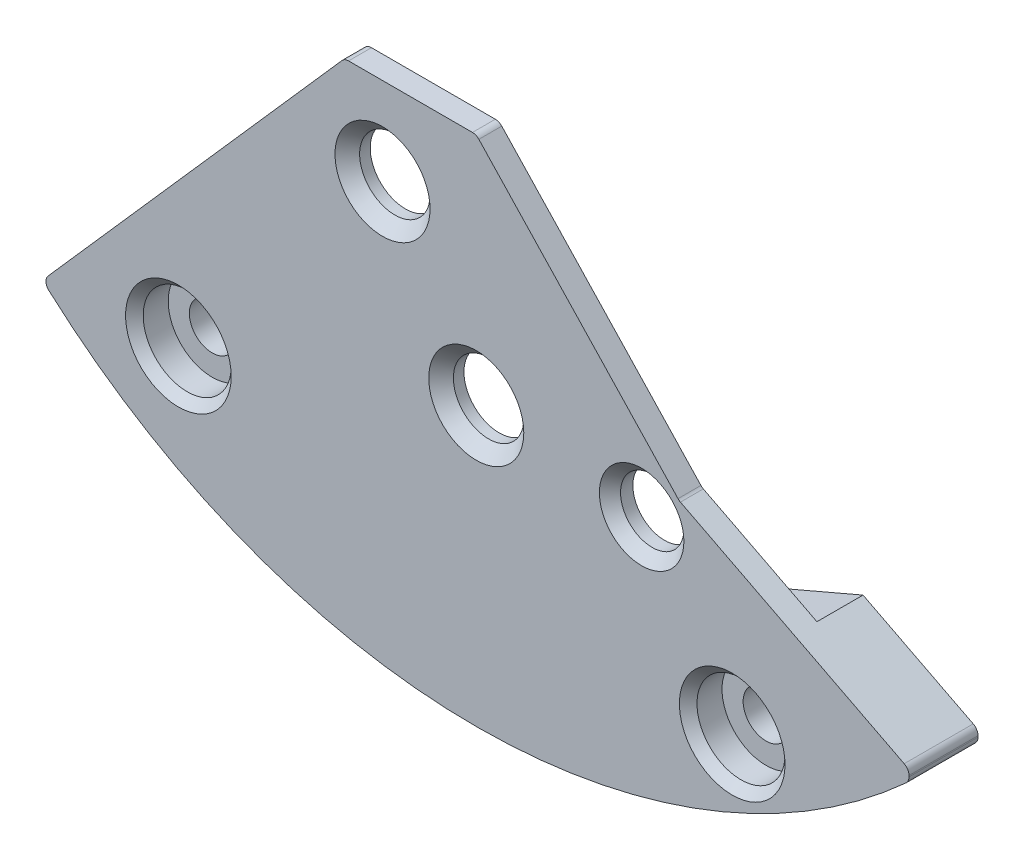
ISO-10303-21;
HEADER;
FILE_DESCRIPTION(('STEP AP214'),'2;1');
FILE_NAME('part.step','',(''),(''),'','','');
FILE_SCHEMA(('AUTOMOTIVE_DESIGN { 1 0 10303 214 1 1 1 1 }'));
ENDSEC;
DATA;
#1=APPLICATION_CONTEXT('core data for automotive mechanical design processes');
#2=APPLICATION_PROTOCOL_DEFINITION('international standard','automotive_design',2000,#1);
#3=PRODUCT_CONTEXT('',#1,'mechanical');
#4=PRODUCT('Part','Part','',(#3));
#5=PRODUCT_RELATED_PRODUCT_CATEGORY('part','',(#4));
#6=PRODUCT_DEFINITION_FORMATION('','',#4);
#7=PRODUCT_DEFINITION_CONTEXT('part definition',#1,'design');
#8=PRODUCT_DEFINITION('design','',#6,#7);
#9=PRODUCT_DEFINITION_SHAPE('','',#8);
#10=(LENGTH_UNIT() NAMED_UNIT(*) SI_UNIT(.MILLI.,.METRE.));
#11=(NAMED_UNIT(*) PLANE_ANGLE_UNIT() SI_UNIT($,.RADIAN.));
#12=(NAMED_UNIT(*) SI_UNIT($,.STERADIAN.) SOLID_ANGLE_UNIT());
#13=UNCERTAINTY_MEASURE_WITH_UNIT(LENGTH_MEASURE(1.E-05),#10,'distance_accuracy_value','');
#14=(GEOMETRIC_REPRESENTATION_CONTEXT(3) GLOBAL_UNCERTAINTY_ASSIGNED_CONTEXT((#13)) GLOBAL_UNIT_ASSIGNED_CONTEXT((#10,
#11,#12)) REPRESENTATION_CONTEXT('',''));
#15=CARTESIAN_POINT('',(0.,0.,0.));
#16=DIRECTION('',(0.,0.,1.));
#17=DIRECTION('',(1.,0.,0.));
#18=AXIS2_PLACEMENT_3D('',#15,#16,#17);
#19=CARTESIAN_POINT('',(0.,0.,0.960000000000001));
#20=DIRECTION('',(0.,0.,1.));
#21=DIRECTION('',(1.,0.,0.));
#22=AXIS2_PLACEMENT_3D('',#19,#20,#21);
#23=PLANE('',#22);
#24=CARTESIAN_POINT('',(-8.45980191055556,-13.0192810651391,0.960000000000001));
#25=DIRECTION('',(0.,0.,-1.));
#26=DIRECTION('',(1.,0.,0.));
#27=AXIS2_PLACEMENT_3D('',#24,#25,#26);
#28=CIRCLE('',#27,4.);
#29=CARTESIAN_POINT('',(-4.56391734086788,-12.1125929050369,0.960000000000001));
#30=VERTEX_POINT('',#29);
#31=CARTESIAN_POINT('',(-7.00300327673048,-16.7445646436718,0.960000000000001));
#32=VERTEX_POINT('',#31);
#33=EDGE_CURVE('E199',#30,#32,#28,.T.);
#34=ORIENTED_EDGE('',*,*,#33,.F.);
#35=DIRECTION('',(0.685364699004991,-0.728199992692803,0.));
#36=VECTOR('',#35,1.);
#37=CARTESIAN_POINT('',(-1.14381879762604,-15.7464476072314,0.960000000000001));
#38=LINE('',#37,#36);
#39=CARTESIAN_POINT('',(-3.3497199663869,-13.402677615423,0.960000000000001));
#40=VERTEX_POINT('',#39);
#41=EDGE_CURVE('E187',#30,#40,#38,.T.);
#42=ORIENTED_EDGE('',*,*,#41,.T.);
#43=CARTESIAN_POINT('',(0.,-10.25,0.960000000000001));
#44=DIRECTION('',(0.,0.,1.));
#45=DIRECTION('',(1.,0.,0.));
#46=AXIS2_PLACEMENT_3D('',#43,#44,#45);
#47=CIRCLE('',#46,4.6);
#48=CARTESIAN_POINT('',(1.81394739478823,-14.4772443564267,0.960000000000001));
#49=VERTEX_POINT('',#48);
#50=EDGE_CURVE('E11',#40,#49,#47,.T.);
#51=ORIENTED_EDGE('',*,*,#50,.T.);
#52=DIRECTION('',(0.918966164440577,0.394336390171355,0.));
#53=VECTOR('',#52,1.);
#54=CARTESIAN_POINT('',(5.12641025322723,-13.0558376749645,0.960000000000001));
#55=LINE('',#54,#53);
#56=CARTESIAN_POINT('',(3.36982635811158,-13.8096031334073,0.960000000000001));
#57=VERTEX_POINT('',#56);
#58=EDGE_CURVE('E324',#49,#57,#55,.T.);
#59=ORIENTED_EDGE('',*,*,#58,.T.);
#60=CARTESIAN_POINT('',(7.26938383343995,-14.7003620775727,0.960000000000001));
#61=DIRECTION('',(0.,0.,-1.));
#62=DIRECTION('',(1.,0.,0.));
#63=AXIS2_PLACEMENT_3D('',#60,#61,#62);
#64=CIRCLE('',#63,4.);
#65=CARTESIAN_POINT('',(4.49726769874477,-17.5840007747335,0.960000000000001));
#66=VERTEX_POINT('',#65);
#67=EDGE_CURVE('E206',#66,#57,#64,.T.);
#68=ORIENTED_EDGE('',*,*,#67,.F.);
#69=CARTESIAN_POINT('',(0.,0.,0.960000000000001));
#70=DIRECTION('',(0.,0.,-1.));
#71=DIRECTION('',(1.,0.,0.));
#72=AXIS2_PLACEMENT_3D('',#69,#70,#71);
#73=CIRCLE('',#72,18.15);
#74=EDGE_CURVE('E226',#66,#32,#73,.T.);
#75=ORIENTED_EDGE('',*,*,#74,.T.);
#76=EDGE_LOOP('',(#34,#42,#51,#59,#68,#75));
#77=FACE_BOUND('',#76,.T.);
#78=ADVANCED_FACE('F32',(#77),#23,.F.);
#79=CARTESIAN_POINT('',(0.,0.,1.31));
#80=DIRECTION('',(0.,0.,1.));
#81=DIRECTION('',(1.,0.,0.));
#82=AXIS2_PLACEMENT_3D('',#79,#80,#81);
#83=PLANE('',#82);
#84=CARTESIAN_POINT('',(4.69701770194955,-10.6460002522325,1.31));
#85=DIRECTION('',(0.,0.,1.));
#86=DIRECTION('',(1.,0.,0.));
#87=AXIS2_PLACEMENT_3D('',#84,#85,#86);
#88=CIRCLE('',#87,0.900000000000006);
#89=CARTESIAN_POINT('',(5.59701770194956,-10.6460002522325,1.31));
#90=VERTEX_POINT('',#89);
#91=EDGE_CURVE('E274',#90,#90,#88,.T.);
#92=ORIENTED_EDGE('',*,*,#91,.T.);
#93=EDGE_LOOP('',(#92));
#94=FACE_BOUND('',#93,.T.);
#95=CARTESIAN_POINT('',(0.,-10.25,1.31));
#96=DIRECTION('',(0.,0.,1.));
#97=DIRECTION('',(1.,0.,0.));
#98=AXIS2_PLACEMENT_3D('',#95,#96,#97);
#99=CIRCLE('',#98,1.00000000000001);
#100=CARTESIAN_POINT('',(1.00000000000001,-10.25,1.31));
#101=VERTEX_POINT('',#100);
#102=EDGE_CURVE('E269',#101,#101,#99,.T.);
#103=ORIENTED_EDGE('',*,*,#102,.T.);
#104=EDGE_LOOP('',(#103));
#105=FACE_BOUND('',#104,.T.);
#106=CARTESIAN_POINT('',(-2.66226199830052,-6.07408479977046,1.31));
#107=DIRECTION('',(0.,0.,1.));
#108=DIRECTION('',(1.,0.,0.));
#109=AXIS2_PLACEMENT_3D('',#106,#107,#108);
#110=CIRCLE('',#109,1.00000000000001);
#111=CARTESIAN_POINT('',(-1.66226199830051,-6.07408479977046,1.31));
#112=VERTEX_POINT('',#111);
#113=EDGE_CURVE('E264',#112,#112,#110,.T.);
#114=ORIENTED_EDGE('',*,*,#113,.T.);
#115=EDGE_LOOP('',(#114));
#116=FACE_BOUND('',#115,.T.);
#117=DIRECTION('',(0.918966164440577,0.394336390171355,0.));
#118=VECTOR('',#117,1.);
#119=CARTESIAN_POINT('',(5.12641025322723,-13.0558376749645,1.31));
#120=LINE('',#119,#118);
#121=CARTESIAN_POINT('',(1.81394739478823,-14.4772443564267,1.31));
#122=VERTEX_POINT('',#121);
#123=CARTESIAN_POINT('',(9.02500000000001,-11.3829188374822,1.31));
#124=VERTEX_POINT('',#123);
#125=EDGE_CURVE('E236',#122,#124,#120,.T.);
#126=ORIENTED_EDGE('',*,*,#125,.F.);
#127=CARTESIAN_POINT('',(0.,-10.25,1.31));
#128=DIRECTION('',(0.,0.,1.));
#129=DIRECTION('',(1.,0.,0.));
#130=AXIS2_PLACEMENT_3D('',#127,#128,#129);
#131=CIRCLE('',#130,4.6);
#132=CARTESIAN_POINT('',(-3.3497199663869,-13.402677615423,1.31));
#133=VERTEX_POINT('',#132);
#134=EDGE_CURVE('E54',#122,#133,#131,.F.);
#135=ORIENTED_EDGE('',*,*,#134,.T.);
#136=DIRECTION('',(0.685364699004991,-0.728199992692803,0.));
#137=VECTOR('',#136,1.);
#138=CARTESIAN_POINT('',(-1.14381879762604,-15.7464476072314,1.31));
#139=LINE('',#138,#137);
#140=CARTESIAN_POINT('',(-8.01670997456033,-8.44400073173869,1.31));
#141=VERTEX_POINT('',#140);
#142=EDGE_CURVE('E322',#141,#133,#139,.T.);
#143=ORIENTED_EDGE('',*,*,#142,.F.);
#144=DIRECTION('',(-0.661079843281002,-0.75031556081929,0.));
#145=VECTOR('',#144,1.);
#146=CARTESIAN_POINT('',(-3.74,-3.59,1.31));
#147=LINE('',#146,#145);
#148=CARTESIAN_POINT('',(-3.81465301793952,-3.67473003917975,1.31));
#149=VERTEX_POINT('',#148);
#150=EDGE_CURVE('E185',#149,#141,#147,.T.);
#151=ORIENTED_EDGE('',*,*,#150,.F.);
#152=CARTESIAN_POINT('',(-3.62707412773469,-3.84,1.31));
#153=DIRECTION('',(0.,0.,1.));
#154=DIRECTION('',(1.,0.,0.));
#155=AXIS2_PLACEMENT_3D('',#152,#153,#154);
#156=CIRCLE('',#155,0.25);
#157=CARTESIAN_POINT('',(-3.62707412773469,-3.59,1.31));
#158=VERTEX_POINT('',#157);
#159=EDGE_CURVE('E391',#149,#158,#156,.F.);
#160=ORIENTED_EDGE('',*,*,#159,.T.);
#161=DIRECTION('',(-1.,0.,0.));
#162=VECTOR('',#161,1.);
#163=CARTESIAN_POINT('',(12.29,-3.59,1.31));
#164=LINE('',#163,#162);
#165=CARTESIAN_POINT('',(-0.108018162644958,-3.59,1.31));
#166=VERTEX_POINT('',#165);
#167=EDGE_CURVE('E305',#166,#158,#164,.T.);
#168=ORIENTED_EDGE('',*,*,#167,.F.);
#169=CARTESIAN_POINT('',(-0.108018162644958,-3.84,1.31));
#170=DIRECTION('',(0.,0.,1.));
#171=DIRECTION('',(1.,0.,0.));
#172=AXIS2_PLACEMENT_3D('',#169,#170,#171);
#173=CIRCLE('',#172,0.25);
#174=CARTESIAN_POINT('',(0.0740318355282419,-3.66865882524875,1.31));
#175=VERTEX_POINT('',#174);
#176=EDGE_CURVE('E419',#166,#175,#173,.F.);
#177=ORIENTED_EDGE('',*,*,#176,.T.);
#178=DIRECTION('',(-0.685364699004993,0.728199992692801,0.));
#179=VECTOR('',#178,1.);
#180=CARTESIAN_POINT('',(-1.79170642201835,-1.68631192660551,1.31));
#181=LINE('',#180,#179);
#182=CARTESIAN_POINT('',(5.73039494494946,-9.67854462900876,1.31));
#183=VERTEX_POINT('',#182);
#184=EDGE_CURVE('E243',#183,#175,#181,.T.);
#185=ORIENTED_EDGE('',*,*,#184,.F.);
#186=CARTESIAN_POINT('',(5.91244494312266,-9.50720345425751,1.31));
#187=DIRECTION('',(0.,0.,1.));
#188=DIRECTION('',(1.,0.,0.));
#189=AXIS2_PLACEMENT_3D('',#186,#187,#188);
#190=CIRCLE('',#189,0.25);
#191=CARTESIAN_POINT('',(5.79844349178114,-9.72969765438872,1.31));
#192=VERTEX_POINT('',#191);
#193=EDGE_CURVE('E421',#183,#192,#190,.T.);
#194=ORIENTED_EDGE('',*,*,#193,.T.);
#195=DIRECTION('',(0.88997680052485,-0.456005805366063,0.));
#196=VECTOR('',#195,1.);
#197=CARTESIAN_POINT('',(12.29,-13.0558376749645,1.31));
#198=LINE('',#197,#196);
#199=EDGE_CURVE('E242',#192,#124,#198,.T.);
#200=ORIENTED_EDGE('',*,*,#199,.T.);
#201=EDGE_LOOP('',(#126,#135,#143,#151,#160,#168,#177,#185,#194,#200));
#202=FACE_BOUND('',#201,.T.);
#203=ADVANCED_FACE('F431',(#94,#105,#116,#202),#83,.F.);
#204=CARTESIAN_POINT('',(12.29,-3.59,1.31));
#205=DIRECTION('',(0.,1.,0.));
#206=DIRECTION('',(-1.,0.,0.));
#207=AXIS2_PLACEMENT_3D('',#204,#205,#206);
#208=PLANE('',#207);
#209=DIRECTION('',(-1.,0.,0.));
#210=VECTOR('',#209,1.);
#211=CARTESIAN_POINT('',(12.29,-3.59,1.96));
#212=LINE('',#211,#210);
#213=CARTESIAN_POINT('',(-0.108018162644958,-3.59,1.96));
#214=VERTEX_POINT('',#213);
#215=CARTESIAN_POINT('',(-3.62707412773469,-3.59,1.96));
#216=VERTEX_POINT('',#215);
#217=EDGE_CURVE('E249',#214,#216,#212,.T.);
#218=ORIENTED_EDGE('',*,*,#217,.F.);
#219=DIRECTION('',(0.,0.,1.));
#220=VECTOR('',#219,1.);
#221=CARTESIAN_POINT('',(-0.108018162644958,-3.59,1.31));
#222=LINE('',#221,#220);
#223=EDGE_CURVE('E416',#214,#166,#222,.F.);
#224=ORIENTED_EDGE('',*,*,#223,.T.);
#225=ORIENTED_EDGE('',*,*,#167,.T.);
#226=DIRECTION('',(0.,0.,1.));
#227=VECTOR('',#226,1.);
#228=CARTESIAN_POINT('',(-3.62707412773469,-3.59,1.31));
#229=LINE('',#228,#227);
#230=EDGE_CURVE('E414',#158,#216,#229,.T.);
#231=ORIENTED_EDGE('',*,*,#230,.T.);
#232=EDGE_LOOP('',(#218,#224,#225,#231));
#233=FACE_BOUND('',#232,.T.);
#234=ADVANCED_FACE('F474',(#233),#208,.T.);
#235=CARTESIAN_POINT('',(12.29,-13.3558376749645,1.31));
#236=DIRECTION('',(1.,0.,0.));
#237=DIRECTION('',(0.,1.,0.));
#238=AXIS2_PLACEMENT_3D('',#235,#236,#237);
#239=PLANE('',#238);
#240=DIRECTION('',(0.,-1.,0.));
#241=VECTOR('',#240,1.);
#242=CARTESIAN_POINT('',(12.29,-13.3558376749645,0.));
#243=LINE('',#242,#241);
#244=CARTESIAN_POINT('',(12.29,-13.2086490163143,0.));
#245=VERTEX_POINT('',#244);
#246=CARTESIAN_POINT('',(12.29,-13.2456936398212,0.));
#247=VERTEX_POINT('',#246);
#248=EDGE_CURVE('E207',#245,#247,#243,.T.);
#249=ORIENTED_EDGE('',*,*,#248,.F.);
#250=DIRECTION('',(0.,0.,1.));
#251=VECTOR('',#250,1.);
#252=CARTESIAN_POINT('',(12.29,-13.2086490163143,1.96));
#253=LINE('',#252,#251);
#254=CARTESIAN_POINT('',(12.29,-13.2086490163143,1.96));
#255=VERTEX_POINT('',#254);
#256=EDGE_CURVE('E412',#245,#255,#253,.T.);
#257=ORIENTED_EDGE('',*,*,#256,.T.);
#258=DIRECTION('',(0.,1.,0.));
#259=VECTOR('',#258,1.);
#260=CARTESIAN_POINT('',(12.29,-13.3558376749645,1.96));
#261=LINE('',#260,#259);
#262=CARTESIAN_POINT('',(12.29,-13.2456936398212,1.96));
#263=VERTEX_POINT('',#262);
#264=EDGE_CURVE('E319',#263,#255,#261,.T.);
#265=ORIENTED_EDGE('',*,*,#264,.F.);
#266=DIRECTION('',(0.,0.,1.));
#267=VECTOR('',#266,1.);
#268=CARTESIAN_POINT('',(12.29,-13.2456936398212,1.31));
#269=LINE('',#268,#267);
#270=EDGE_CURVE('E410',#263,#247,#269,.F.);
#271=ORIENTED_EDGE('',*,*,#270,.T.);
#272=EDGE_LOOP('',(#249,#257,#265,#271));
#273=FACE_BOUND('',#272,.T.);
#274=ADVANCED_FACE('F454',(#273),#239,.T.);
#275=CARTESIAN_POINT('',(0.,0.,1.31));
#276=DIRECTION('',(0.,0.,1.));
#277=DIRECTION('',(1.,0.,0.));
#278=AXIS2_PLACEMENT_3D('',#275,#276,#277);
#279=CYLINDRICAL_SURFACE('',#278,18.15);
#280=CARTESIAN_POINT('',(0.,0.,1.96));
#281=DIRECTION('',(0.,0.,1.));
#282=DIRECTION('',(1.,0.,0.));
#283=AXIS2_PLACEMENT_3D('',#280,#281,#282);
#284=CIRCLE('',#283,18.15);
#285=CARTESIAN_POINT('',(-12.1371248404832,-13.4949138791815,1.96));
#286=VERTEX_POINT('',#285);
#287=CARTESIAN_POINT('',(12.208156424581,-13.4306893610478,1.96));
#288=VERTEX_POINT('',#287);
#289=EDGE_CURVE('E316',#286,#288,#284,.T.);
#290=ORIENTED_EDGE('',*,*,#289,.F.);
#291=DIRECTION('',(0.,0.,1.));
#292=VECTOR('',#291,1.);
#293=CARTESIAN_POINT('',(-12.1371248404832,-13.4949138791815,1.31));
#294=LINE('',#293,#292);
#295=CARTESIAN_POINT('',(-12.1371248404832,-13.4949138791815,0.));
#296=VERTEX_POINT('',#295);
#297=EDGE_CURVE('E345',#286,#296,#294,.F.);
#298=ORIENTED_EDGE('',*,*,#297,.T.);
#299=CARTESIAN_POINT('',(0.,0.,0.));
#300=DIRECTION('',(0.,0.,-1.));
#301=DIRECTION('',(1.,0.,0.));
#302=AXIS2_PLACEMENT_3D('',#299,#300,#301);
#303=CIRCLE('',#302,18.15);
#304=CARTESIAN_POINT('',(-7.00300327673048,-16.7445646436718,0.));
#305=VERTEX_POINT('',#304);
#306=EDGE_CURVE('E179',#305,#296,#303,.T.);
#307=ORIENTED_EDGE('',*,*,#306,.F.);
#308=DIRECTION('',(0.,0.,1.));
#309=VECTOR('',#308,1.);
#310=CARTESIAN_POINT('',(-7.00300327673048,-16.7445646436718,0.));
#311=LINE('',#310,#309);
#312=EDGE_CURVE('E195',#305,#32,#311,.T.);
#313=ORIENTED_EDGE('',*,*,#312,.T.);
#314=ORIENTED_EDGE('',*,*,#74,.F.);
#315=DIRECTION('',(0.,0.,1.));
#316=VECTOR('',#315,1.);
#317=CARTESIAN_POINT('',(4.49726769874478,-17.5840007747335,0.));
#318=LINE('',#317,#316);
#319=CARTESIAN_POINT('',(4.49726769874478,-17.5840007747335,0.));
#320=VERTEX_POINT('',#319);
#321=EDGE_CURVE('E231',#320,#66,#318,.T.);
#322=ORIENTED_EDGE('',*,*,#321,.F.);
#323=CARTESIAN_POINT('',(0.,0.,0.));
#324=DIRECTION('',(0.,0.,-1.));
#325=DIRECTION('',(1.,0.,0.));
#326=AXIS2_PLACEMENT_3D('',#323,#324,#325);
#327=CIRCLE('',#326,18.15);
#328=CARTESIAN_POINT('',(12.208156424581,-13.4306893610478,0.));
#329=VERTEX_POINT('',#328);
#330=EDGE_CURVE('E210',#329,#320,#327,.T.);
#331=ORIENTED_EDGE('',*,*,#330,.F.);
#332=DIRECTION('',(0.,0.,1.));
#333=VECTOR('',#332,1.);
#334=CARTESIAN_POINT('',(12.208156424581,-13.4306893610478,1.31));
#335=LINE('',#334,#333);
#336=EDGE_CURVE('E401',#329,#288,#335,.T.);
#337=ORIENTED_EDGE('',*,*,#336,.T.);
#338=EDGE_LOOP('',(#290,#298,#307,#313,#314,#322,#331,#337));
#339=FACE_BOUND('',#338,.T.);
#340=ADVANCED_FACE('F343',(#339),#279,.T.);
#341=CARTESIAN_POINT('',(-3.74,-3.59,1.31));
#342=DIRECTION('',(-0.75031556081929,0.661079843281002,0.));
#343=DIRECTION('',(-0.661079843281002,-0.75031556081929,0.));
#344=AXIS2_PLACEMENT_3D('',#341,#342,#343);
#345=PLANE('',#344);
#346=DIRECTION('',(0.661079843281002,0.75031556081929,0.));
#347=VECTOR('',#346,1.);
#348=CARTESIAN_POINT('',(-8.01670997456033,-8.44400073173869,0.));
#349=LINE('',#348,#347);
#350=CARTESIAN_POINT('',(-12.1575257025822,-13.1437635618987,0.));
#351=VERTEX_POINT('',#350);
#352=CARTESIAN_POINT('',(-8.01670997456033,-8.44400073173869,0.));
#353=VERTEX_POINT('',#352);
#354=EDGE_CURVE('E167',#351,#353,#349,.T.);
#355=ORIENTED_EDGE('',*,*,#354,.F.);
#356=DIRECTION('',(0.,0.,1.));
#357=VECTOR('',#356,1.);
#358=CARTESIAN_POINT('',(-12.1575257025822,-13.1437635618987,1.31));
#359=LINE('',#358,#357);
#360=CARTESIAN_POINT('',(-12.1575257025822,-13.1437635618987,1.96));
#361=VERTEX_POINT('',#360);
#362=EDGE_CURVE('E385',#351,#361,#359,.T.);
#363=ORIENTED_EDGE('',*,*,#362,.T.);
#364=DIRECTION('',(-0.661079843281002,-0.75031556081929,0.));
#365=VECTOR('',#364,1.);
#366=CARTESIAN_POINT('',(-3.74,-3.59,1.96));
#367=LINE('',#366,#365);
#368=CARTESIAN_POINT('',(-3.81465301793952,-3.67473003917975,1.96));
#369=VERTEX_POINT('',#368);
#370=EDGE_CURVE('E313',#369,#361,#367,.T.);
#371=ORIENTED_EDGE('',*,*,#370,.F.);
#372=DIRECTION('',(0.,0.,1.));
#373=VECTOR('',#372,1.);
#374=CARTESIAN_POINT('',(-3.81465301793952,-3.67473003917975,1.31));
#375=LINE('',#374,#373);
#376=EDGE_CURVE('E302',#369,#149,#375,.F.);
#377=ORIENTED_EDGE('',*,*,#376,.T.);
#378=ORIENTED_EDGE('',*,*,#150,.T.);
#379=DIRECTION('',(0.,0.,1.));
#380=VECTOR('',#379,1.);
#381=CARTESIAN_POINT('',(-8.01670997456033,-8.44400073173869,0.960000000000001));
#382=LINE('',#381,#380);
#383=EDGE_CURVE('E182',#353,#141,#382,.T.);
#384=ORIENTED_EDGE('',*,*,#383,.F.);
#385=EDGE_LOOP('',(#355,#363,#371,#377,#378,#384));
#386=FACE_BOUND('',#385,.T.);
#387=ADVANCED_FACE('F183',(#386),#345,.T.);
#388=CARTESIAN_POINT('',(0.,0.,1.96));
#389=DIRECTION('',(0.,0.,1.));
#390=DIRECTION('',(1.,0.,0.));
#391=AXIS2_PLACEMENT_3D('',#388,#389,#390);
#392=PLANE('',#391);
#393=CARTESIAN_POINT('',(-8.45980191055556,-13.0192810651391,1.96));
#394=DIRECTION('',(0.,0.,1.));
#395=DIRECTION('',(1.,0.,0.));
#396=AXIS2_PLACEMENT_3D('',#393,#394,#395);
#397=CIRCLE('',#396,1.50000000000002);
#398=CARTESIAN_POINT('',(-6.95980191055555,-13.0192810651391,1.96));
#399=VERTEX_POINT('',#398);
#400=EDGE_CURVE('E285',#399,#399,#397,.F.);
#401=ORIENTED_EDGE('',*,*,#400,.T.);
#402=EDGE_LOOP('',(#401));
#403=FACE_BOUND('',#402,.T.);
#404=CARTESIAN_POINT('',(7.26938383343995,-14.7003620775727,1.96));
#405=DIRECTION('',(0.,0.,1.));
#406=DIRECTION('',(1.,0.,0.));
#407=AXIS2_PLACEMENT_3D('',#404,#405,#406);
#408=CIRCLE('',#407,1.50000000000002);
#409=CARTESIAN_POINT('',(8.76938383343996,-14.7003620775727,1.96));
#410=VERTEX_POINT('',#409);
#411=EDGE_CURVE('E282',#410,#410,#408,.F.);
#412=ORIENTED_EDGE('',*,*,#411,.T.);
#413=EDGE_LOOP('',(#412));
#414=FACE_BOUND('',#413,.T.);
#415=CARTESIAN_POINT('',(4.69701770194955,-10.6460002522325,1.96));
#416=DIRECTION('',(0.,0.,1.));
#417=DIRECTION('',(1.,0.,0.));
#418=AXIS2_PLACEMENT_3D('',#415,#416,#417);
#419=CIRCLE('',#418,1.2);
#420=CARTESIAN_POINT('',(5.89701770194955,-10.6460002522325,1.96));
#421=VERTEX_POINT('',#420);
#422=EDGE_CURVE('E365',#421,#421,#419,.T.);
#423=ORIENTED_EDGE('',*,*,#422,.F.);
#424=EDGE_LOOP('',(#423));
#425=FACE_BOUND('',#424,.T.);
#426=CARTESIAN_POINT('',(0.,-10.25,1.96));
#427=DIRECTION('',(0.,0.,1.));
#428=DIRECTION('',(1.,0.,0.));
#429=AXIS2_PLACEMENT_3D('',#426,#427,#428);
#430=CIRCLE('',#429,1.35);
#431=CARTESIAN_POINT('',(1.35,-10.25,1.96));
#432=VERTEX_POINT('',#431);
#433=EDGE_CURVE('E277',#432,#432,#430,.T.);
#434=ORIENTED_EDGE('',*,*,#433,.F.);
#435=EDGE_LOOP('',(#434));
#436=FACE_BOUND('',#435,.T.);
#437=CARTESIAN_POINT('',(-2.66226199830052,-6.07408479977046,1.96));
#438=DIRECTION('',(0.,0.,1.));
#439=DIRECTION('',(1.,0.,0.));
#440=AXIS2_PLACEMENT_3D('',#437,#438,#439);
#441=CIRCLE('',#440,1.35);
#442=CARTESIAN_POINT('',(-1.31226199830052,-6.07408479977046,1.96));
#443=VERTEX_POINT('',#442);
#444=EDGE_CURVE('E272',#443,#443,#441,.T.);
#445=ORIENTED_EDGE('',*,*,#444,.F.);
#446=EDGE_LOOP('',(#445));
#447=FACE_BOUND('',#446,.T.);
#448=ORIENTED_EDGE('',*,*,#370,.T.);
#449=CARTESIAN_POINT('',(-11.9699468123774,-13.3090335227189,1.96));
#450=DIRECTION('',(0.,0.,1.));
#451=DIRECTION('',(1.,0.,0.));
#452=AXIS2_PLACEMENT_3D('',#449,#450,#451);
#453=CIRCLE('',#452,0.25);
#454=EDGE_CURVE('E382',#361,#286,#453,.T.);
#455=ORIENTED_EDGE('',*,*,#454,.T.);
#456=ORIENTED_EDGE('',*,*,#289,.T.);
#457=CARTESIAN_POINT('',(12.04,-13.2456936398212,1.96));
#458=DIRECTION('',(0.,0.,1.));
#459=DIRECTION('',(1.,0.,0.));
#460=AXIS2_PLACEMENT_3D('',#457,#458,#459);
#461=CIRCLE('',#460,0.25);
#462=EDGE_CURVE('E396',#288,#263,#461,.T.);
#463=ORIENTED_EDGE('',*,*,#462,.T.);
#464=ORIENTED_EDGE('',*,*,#264,.T.);
#465=CARTESIAN_POINT('',(12.04,-13.2086490163143,1.96));
#466=DIRECTION('',(0.,0.,1.));
#467=DIRECTION('',(1.,0.,0.));
#468=AXIS2_PLACEMENT_3D('',#465,#466,#467);
#469=CIRCLE('',#468,0.25);
#470=CARTESIAN_POINT('',(12.1540014513415,-12.9861548161831,1.96));
#471=VERTEX_POINT('',#470);
#472=EDGE_CURVE('E398',#255,#471,#469,.T.);
#473=ORIENTED_EDGE('',*,*,#472,.T.);
#474=DIRECTION('',(-0.88997680052485,0.456005805366063,0.));
#475=VECTOR('',#474,1.);
#476=CARTESIAN_POINT('',(-2.74291198989842,-5.35328280509808,1.96));
#477=LINE('',#476,#475);
#478=CARTESIAN_POINT('',(5.79844349178114,-9.72969765438872,1.96));
#479=VERTEX_POINT('',#478);
#480=EDGE_CURVE('E246',#479,#471,#477,.F.);
#481=ORIENTED_EDGE('',*,*,#480,.F.);
#482=CARTESIAN_POINT('',(5.91244494312266,-9.50720345425751,1.96));
#483=DIRECTION('',(0.,0.,1.));
#484=DIRECTION('',(1.,0.,0.));
#485=AXIS2_PLACEMENT_3D('',#482,#483,#484);
#486=CIRCLE('',#485,0.25);
#487=CARTESIAN_POINT('',(5.73039494494946,-9.67854462900876,1.96));
#488=VERTEX_POINT('',#487);
#489=EDGE_CURVE('E423',#479,#488,#486,.F.);
#490=ORIENTED_EDGE('',*,*,#489,.T.);
#491=DIRECTION('',(0.685364699004993,-0.728199992692801,0.));
#492=VECTOR('',#491,1.);
#493=CARTESIAN_POINT('',(0.,-3.59,1.96));
#494=LINE('',#493,#492);
#495=CARTESIAN_POINT('',(0.0740318355282418,-3.66865882524875,1.96));
#496=VERTEX_POINT('',#495);
#497=EDGE_CURVE('E239',#496,#488,#494,.T.);
#498=ORIENTED_EDGE('',*,*,#497,.F.);
#499=CARTESIAN_POINT('',(-0.108018162644958,-3.84,1.96));
#500=DIRECTION('',(0.,0.,1.));
#501=DIRECTION('',(1.,0.,0.));
#502=AXIS2_PLACEMENT_3D('',#499,#500,#501);
#503=CIRCLE('',#502,0.25);
#504=EDGE_CURVE('E392',#496,#214,#503,.T.);
#505=ORIENTED_EDGE('',*,*,#504,.T.);
#506=ORIENTED_EDGE('',*,*,#217,.T.);
#507=CARTESIAN_POINT('',(-3.62707412773469,-3.84,1.96));
#508=DIRECTION('',(0.,0.,1.));
#509=DIRECTION('',(1.,0.,0.));
#510=AXIS2_PLACEMENT_3D('',#507,#508,#509);
#511=CIRCLE('',#510,0.25);
#512=EDGE_CURVE('E383',#216,#369,#511,.T.);
#513=ORIENTED_EDGE('',*,*,#512,.T.);
#514=EDGE_LOOP('',(#448,#455,#456,#463,#464,#473,#481,#490,#498,#505,#506,#513));
#515=FACE_BOUND('',#514,.T.);
#516=ADVANCED_FACE('F371',(#403,#414,#425,#436,#447,#515),#392,.T.);
#517=CARTESIAN_POINT('',(12.29,-13.0558376749645,1.96));
#518=DIRECTION('',(0.456005805366063,0.88997680052485,0.));
#519=DIRECTION('',(-0.88997680052485,0.456005805366063,0.));
#520=AXIS2_PLACEMENT_3D('',#517,#518,#519);
#521=PLANE('',#520);
#522=ORIENTED_EDGE('',*,*,#199,.F.);
#523=DIRECTION('',(0.,0.,-1.));
#524=VECTOR('',#523,1.);
#525=CARTESIAN_POINT('',(5.79844349178114,-9.72969765438872,1.96));
#526=LINE('',#525,#524);
#527=EDGE_CURVE('E300',#192,#479,#526,.F.);
#528=ORIENTED_EDGE('',*,*,#527,.T.);
#529=ORIENTED_EDGE('',*,*,#480,.T.);
#530=DIRECTION('',(0.,0.,-1.));
#531=VECTOR('',#530,1.);
#532=CARTESIAN_POINT('',(12.1540014513415,-12.9861548161831,0.));
#533=LINE('',#532,#531);
#534=CARTESIAN_POINT('',(12.1540014513415,-12.9861548161831,0.));
#535=VERTEX_POINT('',#534);
#536=EDGE_CURVE('E297',#471,#535,#533,.T.);
#537=ORIENTED_EDGE('',*,*,#536,.T.);
#538=DIRECTION('',(-0.88997680052485,0.456005805366063,0.));
#539=VECTOR('',#538,1.);
#540=CARTESIAN_POINT('',(8.98078214130337,-11.3602625162673,0.));
#541=LINE('',#540,#539);
#542=CARTESIAN_POINT('',(9.02500000000002,-11.3829188374822,0.));
#543=VERTEX_POINT('',#542);
#544=EDGE_CURVE('E217',#543,#535,#541,.F.);
#545=ORIENTED_EDGE('',*,*,#544,.F.);
#546=DIRECTION('',(0.,0.,-1.));
#547=VECTOR('',#546,1.);
#548=CARTESIAN_POINT('',(9.02500000000001,-11.3829188374822,1.96));
#549=LINE('',#548,#547);
#550=EDGE_CURVE('E186',#543,#124,#549,.F.);
#551=ORIENTED_EDGE('',*,*,#550,.T.);
#552=EDGE_LOOP('',(#522,#528,#529,#537,#545,#551));
#553=FACE_BOUND('',#552,.T.);
#554=ADVANCED_FACE('F374',(#553),#521,.T.);
#555=CARTESIAN_POINT('',(0.,-3.59,1.31));
#556=DIRECTION('',(0.728199992692801,0.685364699004993,0.));
#557=DIRECTION('',(-0.685364699004993,0.728199992692801,0.));
#558=AXIS2_PLACEMENT_3D('',#555,#556,#557);
#559=PLANE('',#558);
#560=ORIENTED_EDGE('',*,*,#497,.T.);
#561=DIRECTION('',(0.,0.,1.));
#562=VECTOR('',#561,1.);
#563=CARTESIAN_POINT('',(5.73039494494946,-9.67854462900876,1.31));
#564=LINE('',#563,#562);
#565=EDGE_CURVE('E294',#488,#183,#564,.F.);
#566=ORIENTED_EDGE('',*,*,#565,.T.);
#567=ORIENTED_EDGE('',*,*,#184,.T.);
#568=DIRECTION('',(0.,0.,1.));
#569=VECTOR('',#568,1.);
#570=CARTESIAN_POINT('',(0.0740318355282418,-3.66865882524875,1.31));
#571=LINE('',#570,#569);
#572=EDGE_CURVE('E291',#175,#496,#571,.T.);
#573=ORIENTED_EDGE('',*,*,#572,.T.);
#574=EDGE_LOOP('',(#560,#566,#567,#573));
#575=FACE_BOUND('',#574,.T.);
#576=ADVANCED_FACE('F466',(#575),#559,.T.);
#577=CARTESIAN_POINT('',(5.12641025322723,-13.0558376749645,0.960000000000001));
#578=DIRECTION('',(0.394336390171355,-0.918966164440577,0.));
#579=DIRECTION('',(0.918966164440577,0.394336390171355,0.));
#580=AXIS2_PLACEMENT_3D('',#577,#578,#579);
#581=PLANE('',#580);
#582=ORIENTED_EDGE('',*,*,#58,.F.);
#583=DIRECTION('',(0.,0.,1.));
#584=VECTOR('',#583,1.);
#585=CARTESIAN_POINT('',(1.81394739478823,-14.4772443564267,1.31));
#586=LINE('',#585,#584);
#587=EDGE_CURVE('E424',#49,#122,#586,.T.);
#588=ORIENTED_EDGE('',*,*,#587,.T.);
#589=ORIENTED_EDGE('',*,*,#125,.T.);
#590=ORIENTED_EDGE('',*,*,#550,.F.);
#591=DIRECTION('',(0.918966164440577,0.394336390171355,0.));
#592=VECTOR('',#591,1.);
#593=CARTESIAN_POINT('',(5.12641025322723,-13.0558376749645,0.));
#594=LINE('',#593,#592);
#595=CARTESIAN_POINT('',(3.36982635811158,-13.8096031334073,0.));
#596=VERTEX_POINT('',#595);
#597=EDGE_CURVE('E214',#596,#543,#594,.T.);
#598=ORIENTED_EDGE('',*,*,#597,.F.);
#599=DIRECTION('',(0.,0.,1.));
#600=VECTOR('',#599,1.);
#601=CARTESIAN_POINT('',(3.36982635811158,-13.8096031334073,0.));
#602=LINE('',#601,#600);
#603=EDGE_CURVE('E228',#596,#57,#602,.T.);
#604=ORIENTED_EDGE('',*,*,#603,.T.);
#605=EDGE_LOOP('',(#582,#588,#589,#590,#598,#604));
#606=FACE_BOUND('',#605,.T.);
#607=ADVANCED_FACE('F429',(#606),#581,.F.);
#608=CARTESIAN_POINT('',(-1.14381879762604,-15.7464476072314,0.960000000000001));
#609=DIRECTION('',(-0.728199992692803,-0.685364699004991,0.));
#610=DIRECTION('',(0.685364699004991,-0.728199992692803,0.));
#611=AXIS2_PLACEMENT_3D('',#608,#609,#610);
#612=PLANE('',#611);
#613=ORIENTED_EDGE('',*,*,#142,.T.);
#614=DIRECTION('',(0.,0.,1.));
#615=VECTOR('',#614,1.);
#616=CARTESIAN_POINT('',(-3.3497199663869,-13.402677615423,0.960000000000001));
#617=LINE('',#616,#615);
#618=EDGE_CURVE('E40',#133,#40,#617,.F.);
#619=ORIENTED_EDGE('',*,*,#618,.T.);
#620=ORIENTED_EDGE('',*,*,#41,.F.);
#621=DIRECTION('',(0.,0.,1.));
#622=VECTOR('',#621,1.);
#623=CARTESIAN_POINT('',(-4.56391734086788,-12.1125929050369,0.));
#624=LINE('',#623,#622);
#625=CARTESIAN_POINT('',(-4.56391734086788,-12.1125929050369,0.));
#626=VERTEX_POINT('',#625);
#627=EDGE_CURVE('E191',#626,#30,#624,.T.);
#628=ORIENTED_EDGE('',*,*,#627,.F.);
#629=DIRECTION('',(0.685364699004991,-0.728199992692803,0.));
#630=VECTOR('',#629,1.);
#631=CARTESIAN_POINT('',(-4.56391734086788,-12.1125929050369,0.));
#632=LINE('',#631,#630);
#633=EDGE_CURVE('E172',#353,#626,#632,.T.);
#634=ORIENTED_EDGE('',*,*,#633,.F.);
#635=ORIENTED_EDGE('',*,*,#383,.T.);
#636=EDGE_LOOP('',(#613,#619,#620,#628,#634,#635));
#637=FACE_BOUND('',#636,.T.);
#638=ADVANCED_FACE('F189',(#637),#612,.F.);
#639=CARTESIAN_POINT('',(7.26938383343995,-14.7003620775727,0.));
#640=DIRECTION('',(0.,0.,1.));
#641=DIRECTION('',(1.,0.,0.));
#642=AXIS2_PLACEMENT_3D('',#639,#640,#641);
#643=CYLINDRICAL_SURFACE('',#642,4.);
#644=ORIENTED_EDGE('',*,*,#67,.T.);
#645=ORIENTED_EDGE('',*,*,#603,.F.);
#646=CARTESIAN_POINT('',(7.26938383343995,-14.7003620775727,0.));
#647=DIRECTION('',(0.,0.,-1.));
#648=DIRECTION('',(1.,0.,0.));
#649=AXIS2_PLACEMENT_3D('',#646,#647,#648);
#650=CIRCLE('',#649,4.);
#651=EDGE_CURVE('E212',#320,#596,#650,.T.);
#652=ORIENTED_EDGE('',*,*,#651,.F.);
#653=ORIENTED_EDGE('',*,*,#321,.T.);
#654=EDGE_LOOP('',(#644,#645,#652,#653));
#655=FACE_BOUND('',#654,.T.);
#656=ADVANCED_FACE('F444',(#655),#643,.T.);
#657=CARTESIAN_POINT('',(7.26938383343995,-14.7003620775727,0.));
#658=DIRECTION('',(0.,0.,1.));
#659=DIRECTION('',(1.,0.,0.));
#660=AXIS2_PLACEMENT_3D('',#657,#658,#659);
#661=PLANE('',#660);
#662=CARTESIAN_POINT('',(7.26938383343995,-14.7003620775727,0.));
#663=DIRECTION('',(0.,0.,1.));
#664=DIRECTION('',(1.,0.,0.));
#665=AXIS2_PLACEMENT_3D('',#662,#663,#664);
#666=CIRCLE('',#665,0.650000000000013);
#667=CARTESIAN_POINT('',(7.91938383343996,-14.7003620775727,0.));
#668=VERTEX_POINT('',#667);
#669=EDGE_CURVE('E259',#668,#668,#666,.T.);
#670=ORIENTED_EDGE('',*,*,#669,.T.);
#671=EDGE_LOOP('',(#670));
#672=FACE_BOUND('',#671,.T.);
#673=ORIENTED_EDGE('',*,*,#544,.T.);
#674=CARTESIAN_POINT('',(12.04,-13.2086490163143,0.));
#675=DIRECTION('',(0.,0.,1.));
#676=DIRECTION('',(1.,0.,0.));
#677=AXIS2_PLACEMENT_3D('',#674,#675,#676);
#678=CIRCLE('',#677,0.25);
#679=EDGE_CURVE('E408',#535,#245,#678,.F.);
#680=ORIENTED_EDGE('',*,*,#679,.T.);
#681=ORIENTED_EDGE('',*,*,#248,.T.);
#682=CARTESIAN_POINT('',(12.04,-13.2456936398212,0.));
#683=DIRECTION('',(0.,0.,1.));
#684=DIRECTION('',(1.,0.,0.));
#685=AXIS2_PLACEMENT_3D('',#682,#683,#684);
#686=CIRCLE('',#685,0.25);
#687=EDGE_CURVE('E406',#247,#329,#686,.F.);
#688=ORIENTED_EDGE('',*,*,#687,.T.);
#689=ORIENTED_EDGE('',*,*,#330,.T.);
#690=ORIENTED_EDGE('',*,*,#651,.T.);
#691=ORIENTED_EDGE('',*,*,#597,.T.);
#692=EDGE_LOOP('',(#673,#680,#681,#688,#689,#690,#691));
#693=FACE_BOUND('',#692,.T.);
#694=ADVANCED_FACE('F439',(#672,#693),#661,.F.);
#695=CARTESIAN_POINT('',(-8.45980191055556,-13.0192810651391,0.));
#696=DIRECTION('',(0.,0.,1.));
#697=DIRECTION('',(1.,0.,0.));
#698=AXIS2_PLACEMENT_3D('',#695,#696,#697);
#699=CYLINDRICAL_SURFACE('',#698,4.);
#700=ORIENTED_EDGE('',*,*,#33,.T.);
#701=ORIENTED_EDGE('',*,*,#312,.F.);
#702=CARTESIAN_POINT('',(-8.45980191055556,-13.0192810651391,0.));
#703=DIRECTION('',(0.,0.,-1.));
#704=DIRECTION('',(1.,0.,0.));
#705=AXIS2_PLACEMENT_3D('',#702,#703,#704);
#706=CIRCLE('',#705,4.);
#707=EDGE_CURVE('E193',#626,#305,#706,.T.);
#708=ORIENTED_EDGE('',*,*,#707,.F.);
#709=ORIENTED_EDGE('',*,*,#627,.T.);
#710=EDGE_LOOP('',(#700,#701,#708,#709));
#711=FACE_BOUND('',#710,.T.);
#712=ADVANCED_FACE('F340',(#711),#699,.T.);
#713=CARTESIAN_POINT('',(0.,0.,0.));
#714=DIRECTION('',(0.,0.,1.));
#715=DIRECTION('',(1.,0.,0.));
#716=AXIS2_PLACEMENT_3D('',#713,#714,#715);
#717=PLANE('',#716);
#718=CARTESIAN_POINT('',(-8.45980191055556,-13.0192810651391,0.));
#719=DIRECTION('',(0.,0.,1.));
#720=DIRECTION('',(1.,0.,0.));
#721=AXIS2_PLACEMENT_3D('',#718,#719,#720);
#722=CIRCLE('',#721,0.650000000000013);
#723=CARTESIAN_POINT('',(-7.80980191055555,-13.0192810651391,0.));
#724=VERTEX_POINT('',#723);
#725=EDGE_CURVE('E202',#724,#724,#722,.T.);
#726=ORIENTED_EDGE('',*,*,#725,.T.);
#727=EDGE_LOOP('',(#726));
#728=FACE_BOUND('',#727,.T.);
#729=ORIENTED_EDGE('',*,*,#306,.T.);
#730=CARTESIAN_POINT('',(-11.9699468123774,-13.3090335227189,0.));
#731=DIRECTION('',(0.,0.,1.));
#732=DIRECTION('',(1.,0.,0.));
#733=AXIS2_PLACEMENT_3D('',#730,#731,#732);
#734=CIRCLE('',#733,0.25);
#735=EDGE_CURVE('E175',#296,#351,#734,.F.);
#736=ORIENTED_EDGE('',*,*,#735,.T.);
#737=ORIENTED_EDGE('',*,*,#354,.T.);
#738=ORIENTED_EDGE('',*,*,#633,.T.);
#739=ORIENTED_EDGE('',*,*,#707,.T.);
#740=EDGE_LOOP('',(#729,#736,#737,#738,#739));
#741=FACE_BOUND('',#740,.T.);
#742=ADVANCED_FACE('F170',(#728,#741),#717,.F.);
#743=CARTESIAN_POINT('',(-8.45980191055556,-13.0192810651391,1.96));
#744=DIRECTION('',(0.,0.,1.));
#745=DIRECTION('',(1.,0.,0.));
#746=AXIS2_PLACEMENT_3D('',#743,#744,#745);
#747=CYLINDRICAL_SURFACE('',#746,0.650000000000013);
#748=CARTESIAN_POINT('',(-8.45980191055556,-13.0192810651391,0.999999999999997));
#749=DIRECTION('',(0.,0.,1.));
#750=DIRECTION('',(1.,0.,0.));
#751=AXIS2_PLACEMENT_3D('',#748,#749,#750);
#752=CIRCLE('',#751,0.650000000000013);
#753=CARTESIAN_POINT('',(-7.80980191055555,-13.0192810651391,0.999999999999997));
#754=VERTEX_POINT('',#753);
#755=EDGE_CURVE('E258',#754,#754,#752,.T.);
#756=ORIENTED_EDGE('',*,*,#755,.T.);
#757=EDGE_LOOP('',(#756));
#758=FACE_BOUND('',#757,.T.);
#759=ORIENTED_EDGE('',*,*,#725,.F.);
#760=EDGE_LOOP('',(#759));
#761=FACE_BOUND('',#760,.T.);
#762=ADVANCED_FACE('F554',(#758,#761),#747,.F.);
#763=CARTESIAN_POINT('',(-7.80980191055555,-13.0192810651391,0.999999999999999));
#764=DIRECTION('',(0.,0.,-1.));
#765=DIRECTION('',(-1.,0.,0.));
#766=AXIS2_PLACEMENT_3D('',#763,#764,#765);
#767=PLANE('',#766);
#768=ORIENTED_EDGE('',*,*,#755,.F.);
#769=EDGE_LOOP('',(#768));
#770=FACE_BOUND('',#769,.T.);
#771=CARTESIAN_POINT('',(-8.45980191055556,-13.0192810651391,1.));
#772=DIRECTION('',(0.,0.,1.));
#773=DIRECTION('',(1.,0.,0.));
#774=AXIS2_PLACEMENT_3D('',#771,#772,#773);
#775=CIRCLE('',#774,1.25000000000002);
#776=CARTESIAN_POINT('',(-7.20980191055555,-13.0192810651391,1.));
#777=VERTEX_POINT('',#776);
#778=EDGE_CURVE('E262',#777,#777,#775,.T.);
#779=ORIENTED_EDGE('',*,*,#778,.T.);
#780=EDGE_LOOP('',(#779));
#781=FACE_BOUND('',#780,.T.);
#782=ADVANCED_FACE('F562',(#770,#781),#767,.F.);
#783=CARTESIAN_POINT('',(-8.45980191055556,-13.0192810651391,1.96));
#784=DIRECTION('',(0.,0.,1.));
#785=DIRECTION('',(1.,0.,0.));
#786=AXIS2_PLACEMENT_3D('',#783,#784,#785);
#787=CYLINDRICAL_SURFACE('',#786,1.25000000000002);
#788=CARTESIAN_POINT('',(-8.45980191055556,-13.0192810651391,1.71));
#789=DIRECTION('',(0.,0.,1.));
#790=DIRECTION('',(1.,0.,0.));
#791=AXIS2_PLACEMENT_3D('',#788,#789,#790);
#792=CIRCLE('',#791,1.25000000000002);
#793=CARTESIAN_POINT('',(-7.20980191055555,-13.0192810651391,1.71));
#794=VERTEX_POINT('',#793);
#795=EDGE_CURVE('E279',#794,#794,#792,.T.);
#796=ORIENTED_EDGE('',*,*,#795,.T.);
#797=EDGE_LOOP('',(#796));
#798=FACE_BOUND('',#797,.T.);
#799=ORIENTED_EDGE('',*,*,#778,.F.);
#800=EDGE_LOOP('',(#799));
#801=FACE_BOUND('',#800,.T.);
#802=ADVANCED_FACE('F570',(#798,#801),#787,.F.);
#803=CARTESIAN_POINT('',(7.26938383343995,-14.7003620775727,1.96));
#804=DIRECTION('',(0.,0.,1.));
#805=DIRECTION('',(1.,0.,0.));
#806=AXIS2_PLACEMENT_3D('',#803,#804,#805);
#807=CYLINDRICAL_SURFACE('',#806,0.650000000000013);
#808=CARTESIAN_POINT('',(7.26938383343995,-14.7003620775727,0.999999999999997));
#809=DIRECTION('',(0.,0.,1.));
#810=DIRECTION('',(1.,0.,0.));
#811=AXIS2_PLACEMENT_3D('',#808,#809,#810);
#812=CIRCLE('',#811,0.650000000000013);
#813=CARTESIAN_POINT('',(7.91938383343996,-14.7003620775727,0.999999999999997));
#814=VERTEX_POINT('',#813);
#815=EDGE_CURVE('E263',#814,#814,#812,.T.);
#816=ORIENTED_EDGE('',*,*,#815,.T.);
#817=EDGE_LOOP('',(#816));
#818=FACE_BOUND('',#817,.T.);
#819=ORIENTED_EDGE('',*,*,#669,.F.);
#820=EDGE_LOOP('',(#819));
#821=FACE_BOUND('',#820,.T.);
#822=ADVANCED_FACE('F579',(#818,#821),#807,.F.);
#823=CARTESIAN_POINT('',(7.91938383343996,-14.7003620775727,0.999999999999999));
#824=DIRECTION('',(0.,0.,-1.));
#825=DIRECTION('',(-1.,0.,0.));
#826=AXIS2_PLACEMENT_3D('',#823,#824,#825);
#827=PLANE('',#826);
#828=ORIENTED_EDGE('',*,*,#815,.F.);
#829=EDGE_LOOP('',(#828));
#830=FACE_BOUND('',#829,.T.);
#831=CARTESIAN_POINT('',(7.26938383343995,-14.7003620775727,1.));
#832=DIRECTION('',(0.,0.,1.));
#833=DIRECTION('',(1.,0.,0.));
#834=AXIS2_PLACEMENT_3D('',#831,#832,#833);
#835=CIRCLE('',#834,1.25000000000002);
#836=CARTESIAN_POINT('',(8.51938383343996,-14.7003620775727,1.));
#837=VERTEX_POINT('',#836);
#838=EDGE_CURVE('E267',#837,#837,#835,.T.);
#839=ORIENTED_EDGE('',*,*,#838,.T.);
#840=EDGE_LOOP('',(#839));
#841=FACE_BOUND('',#840,.T.);
#842=ADVANCED_FACE('F588',(#830,#841),#827,.F.);
#843=CARTESIAN_POINT('',(7.26938383343995,-14.7003620775727,1.96));
#844=DIRECTION('',(0.,0.,1.));
#845=DIRECTION('',(1.,0.,0.));
#846=AXIS2_PLACEMENT_3D('',#843,#844,#845);
#847=CYLINDRICAL_SURFACE('',#846,1.25000000000002);
#848=CARTESIAN_POINT('',(7.26938383343995,-14.7003620775727,1.71));
#849=DIRECTION('',(0.,0.,1.));
#850=DIRECTION('',(1.,0.,0.));
#851=AXIS2_PLACEMENT_3D('',#848,#849,#850);
#852=CIRCLE('',#851,1.25000000000002);
#853=CARTESIAN_POINT('',(8.51938383343996,-14.7003620775727,1.71));
#854=VERTEX_POINT('',#853);
#855=EDGE_CURVE('E288',#854,#854,#852,.T.);
#856=ORIENTED_EDGE('',*,*,#855,.T.);
#857=EDGE_LOOP('',(#856));
#858=FACE_BOUND('',#857,.T.);
#859=ORIENTED_EDGE('',*,*,#838,.F.);
#860=EDGE_LOOP('',(#859));
#861=FACE_BOUND('',#860,.T.);
#862=ADVANCED_FACE('F596',(#858,#861),#847,.F.);
#863=CARTESIAN_POINT('',(-2.66226199830052,-6.07408479977046,1.96));
#864=DIRECTION('',(0.,0.,1.));
#865=DIRECTION('',(1.,0.,0.));
#866=AXIS2_PLACEMENT_3D('',#863,#864,#865);
#867=CYLINDRICAL_SURFACE('',#866,1.00000000000001);
#868=CARTESIAN_POINT('',(-2.66226199830052,-6.07408479977046,1.61000000000001));
#869=DIRECTION('',(0.,0.,1.));
#870=DIRECTION('',(1.,0.,0.));
#871=AXIS2_PLACEMENT_3D('',#868,#869,#870);
#872=CIRCLE('',#871,1.00000000000001);
#873=CARTESIAN_POINT('',(-1.6622619983005,-6.07408479977046,1.61000000000001));
#874=VERTEX_POINT('',#873);
#875=EDGE_CURVE('E268',#874,#874,#872,.T.);
#876=ORIENTED_EDGE('',*,*,#875,.T.);
#877=EDGE_LOOP('',(#876));
#878=FACE_BOUND('',#877,.T.);
#879=ORIENTED_EDGE('',*,*,#113,.F.);
#880=EDGE_LOOP('',(#879));
#881=FACE_BOUND('',#880,.T.);
#882=ADVANCED_FACE('F604',(#878,#881),#867,.F.);
#883=CARTESIAN_POINT('',(-2.66226199830052,-6.07408479977046,1.96));
#884=DIRECTION('',(0.,0.,1.));
#885=DIRECTION('',(1.,0.,0.));
#886=AXIS2_PLACEMENT_3D('',#883,#884,#885);
#887=CONICAL_SURFACE('',#886,1.35,0.785398163397442);
#888=ORIENTED_EDGE('',*,*,#875,.F.);
#889=EDGE_LOOP('',(#888));
#890=FACE_BOUND('',#889,.T.);
#891=ORIENTED_EDGE('',*,*,#444,.T.);
#892=EDGE_LOOP('',(#891));
#893=FACE_BOUND('',#892,.T.);
#894=ADVANCED_FACE('F612',(#890,#893),#887,.F.);
#895=CARTESIAN_POINT('',(0.,-10.25,1.96));
#896=DIRECTION('',(0.,0.,1.));
#897=DIRECTION('',(1.,0.,0.));
#898=AXIS2_PLACEMENT_3D('',#895,#896,#897);
#899=CYLINDRICAL_SURFACE('',#898,1.00000000000001);
#900=CARTESIAN_POINT('',(0.,-10.25,1.61000000000001));
#901=DIRECTION('',(0.,0.,1.));
#902=DIRECTION('',(1.,0.,0.));
#903=AXIS2_PLACEMENT_3D('',#900,#901,#902);
#904=CIRCLE('',#903,1.00000000000001);
#905=CARTESIAN_POINT('',(1.00000000000001,-10.25,1.61000000000001));
#906=VERTEX_POINT('',#905);
#907=EDGE_CURVE('E273',#906,#906,#904,.T.);
#908=ORIENTED_EDGE('',*,*,#907,.T.);
#909=EDGE_LOOP('',(#908));
#910=FACE_BOUND('',#909,.T.);
#911=ORIENTED_EDGE('',*,*,#102,.F.);
#912=EDGE_LOOP('',(#911));
#913=FACE_BOUND('',#912,.T.);
#914=ADVANCED_FACE('F620',(#910,#913),#899,.F.);
#915=CARTESIAN_POINT('',(0.,-10.25,1.96));
#916=DIRECTION('',(0.,0.,1.));
#917=DIRECTION('',(1.,0.,0.));
#918=AXIS2_PLACEMENT_3D('',#915,#916,#917);
#919=CONICAL_SURFACE('',#918,1.35,0.785398163397442);
#920=ORIENTED_EDGE('',*,*,#907,.F.);
#921=EDGE_LOOP('',(#920));
#922=FACE_BOUND('',#921,.T.);
#923=ORIENTED_EDGE('',*,*,#433,.T.);
#924=EDGE_LOOP('',(#923));
#925=FACE_BOUND('',#924,.T.);
#926=ADVANCED_FACE('F628',(#922,#925),#919,.F.);
#927=CARTESIAN_POINT('',(4.69701770194955,-10.6460002522325,1.96));
#928=DIRECTION('',(0.,0.,1.));
#929=DIRECTION('',(1.,0.,0.));
#930=AXIS2_PLACEMENT_3D('',#927,#928,#929);
#931=CYLINDRICAL_SURFACE('',#930,0.900000000000006);
#932=CARTESIAN_POINT('',(4.69701770194955,-10.6460002522325,1.66000000000001));
#933=DIRECTION('',(0.,0.,1.));
#934=DIRECTION('',(1.,0.,0.));
#935=AXIS2_PLACEMENT_3D('',#932,#933,#934);
#936=CIRCLE('',#935,0.900000000000012);
#937=CARTESIAN_POINT('',(5.59701770194956,-10.6460002522325,1.66000000000001));
#938=VERTEX_POINT('',#937);
#939=EDGE_CURVE('E278',#938,#938,#936,.T.);
#940=ORIENTED_EDGE('',*,*,#939,.T.);
#941=EDGE_LOOP('',(#940));
#942=FACE_BOUND('',#941,.T.);
#943=ORIENTED_EDGE('',*,*,#91,.F.);
#944=EDGE_LOOP('',(#943));
#945=FACE_BOUND('',#944,.T.);
#946=ADVANCED_FACE('F636',(#942,#945),#931,.F.);
#947=CARTESIAN_POINT('',(4.69701770194955,-10.6460002522325,1.96));
#948=DIRECTION('',(0.,0.,1.));
#949=DIRECTION('',(1.,0.,0.));
#950=AXIS2_PLACEMENT_3D('',#947,#948,#949);
#951=CONICAL_SURFACE('',#950,1.2,0.785398163397427);
#952=ORIENTED_EDGE('',*,*,#939,.F.);
#953=EDGE_LOOP('',(#952));
#954=FACE_BOUND('',#953,.T.);
#955=ORIENTED_EDGE('',*,*,#422,.T.);
#956=EDGE_LOOP('',(#955));
#957=FACE_BOUND('',#956,.T.);
#958=ADVANCED_FACE('F369',(#954,#957),#951,.F.);
#959=CARTESIAN_POINT('',(-8.45980191055556,-13.0192810651391,1.71));
#960=DIRECTION('',(0.,0.,1.));
#961=DIRECTION('',(1.,0.,0.));
#962=AXIS2_PLACEMENT_3D('',#959,#960,#961);
#963=CONICAL_SURFACE('',#962,1.25000000000002,0.785398163397458);
#964=ORIENTED_EDGE('',*,*,#400,.F.);
#965=EDGE_LOOP('',(#964));
#966=FACE_BOUND('',#965,.T.);
#967=ORIENTED_EDGE('',*,*,#795,.F.);
#968=EDGE_LOOP('',(#967));
#969=FACE_BOUND('',#968,.T.);
#970=ADVANCED_FACE('F650',(#966,#969),#963,.F.);
#971=CARTESIAN_POINT('',(7.26938383343995,-14.7003620775727,1.71));
#972=DIRECTION('',(0.,0.,1.));
#973=DIRECTION('',(1.,0.,0.));
#974=AXIS2_PLACEMENT_3D('',#971,#972,#973);
#975=CONICAL_SURFACE('',#974,1.25000000000002,0.785398163397458);
#976=ORIENTED_EDGE('',*,*,#411,.F.);
#977=EDGE_LOOP('',(#976));
#978=FACE_BOUND('',#977,.T.);
#979=ORIENTED_EDGE('',*,*,#855,.F.);
#980=EDGE_LOOP('',(#979));
#981=FACE_BOUND('',#980,.T.);
#982=ADVANCED_FACE('F657',(#978,#981),#975,.F.);
#983=CARTESIAN_POINT('',(5.91244494312266,-9.50720345425751,1.31));
#984=DIRECTION('',(0.,0.,1.));
#985=DIRECTION('',(1.,0.,0.));
#986=AXIS2_PLACEMENT_3D('',#983,#984,#985);
#987=CYLINDRICAL_SURFACE('',#986,0.25);
#988=ORIENTED_EDGE('',*,*,#489,.F.);
#989=ORIENTED_EDGE('',*,*,#527,.F.);
#990=ORIENTED_EDGE('',*,*,#193,.F.);
#991=ORIENTED_EDGE('',*,*,#565,.F.);
#992=EDGE_LOOP('',(#988,#989,#990,#991));
#993=FACE_BOUND('',#992,.T.);
#994=ADVANCED_FACE('F462',(#993),#987,.F.);
#995=CARTESIAN_POINT('',(-11.9699468123774,-13.3090335227189,1.31));
#996=DIRECTION('',(0.,0.,1.));
#997=DIRECTION('',(1.,0.,0.));
#998=AXIS2_PLACEMENT_3D('',#995,#996,#997);
#999=CYLINDRICAL_SURFACE('',#998,0.25);
#1000=ORIENTED_EDGE('',*,*,#735,.F.);
#1001=ORIENTED_EDGE('',*,*,#297,.F.);
#1002=ORIENTED_EDGE('',*,*,#454,.F.);
#1003=ORIENTED_EDGE('',*,*,#362,.F.);
#1004=EDGE_LOOP('',(#1000,#1001,#1002,#1003));
#1005=FACE_BOUND('',#1004,.T.);
#1006=ADVANCED_FACE('F671',(#1005),#999,.T.);
#1007=CARTESIAN_POINT('',(12.04,-13.2086490163143,1.96));
#1008=DIRECTION('',(0.,0.,-1.));
#1009=DIRECTION('',(-1.,0.,0.));
#1010=AXIS2_PLACEMENT_3D('',#1007,#1008,#1009);
#1011=CYLINDRICAL_SURFACE('',#1010,0.25);
#1012=ORIENTED_EDGE('',*,*,#472,.F.);
#1013=ORIENTED_EDGE('',*,*,#256,.F.);
#1014=ORIENTED_EDGE('',*,*,#679,.F.);
#1015=ORIENTED_EDGE('',*,*,#536,.F.);
#1016=EDGE_LOOP('',(#1012,#1013,#1014,#1015));
#1017=FACE_BOUND('',#1016,.T.);
#1018=ADVANCED_FACE('F457',(#1017),#1011,.T.);
#1019=CARTESIAN_POINT('',(12.04,-13.2456936398212,1.31));
#1020=DIRECTION('',(0.,0.,1.));
#1021=DIRECTION('',(1.,0.,0.));
#1022=AXIS2_PLACEMENT_3D('',#1019,#1020,#1021);
#1023=CYLINDRICAL_SURFACE('',#1022,0.25);
#1024=ORIENTED_EDGE('',*,*,#687,.F.);
#1025=ORIENTED_EDGE('',*,*,#270,.F.);
#1026=ORIENTED_EDGE('',*,*,#462,.F.);
#1027=ORIENTED_EDGE('',*,*,#336,.F.);
#1028=EDGE_LOOP('',(#1024,#1025,#1026,#1027));
#1029=FACE_BOUND('',#1028,.T.);
#1030=ADVANCED_FACE('F448',(#1029),#1023,.T.);
#1031=CARTESIAN_POINT('',(-0.108018162644958,-3.84,1.31));
#1032=DIRECTION('',(0.,0.,1.));
#1033=DIRECTION('',(1.,0.,0.));
#1034=AXIS2_PLACEMENT_3D('',#1031,#1032,#1033);
#1035=CYLINDRICAL_SURFACE('',#1034,0.25);
#1036=ORIENTED_EDGE('',*,*,#176,.F.);
#1037=ORIENTED_EDGE('',*,*,#223,.F.);
#1038=ORIENTED_EDGE('',*,*,#504,.F.);
#1039=ORIENTED_EDGE('',*,*,#572,.F.);
#1040=EDGE_LOOP('',(#1036,#1037,#1038,#1039));
#1041=FACE_BOUND('',#1040,.T.);
#1042=ADVANCED_FACE('F470',(#1041),#1035,.T.);
#1043=CARTESIAN_POINT('',(-3.62707412773469,-3.84,1.31));
#1044=DIRECTION('',(0.,0.,1.));
#1045=DIRECTION('',(1.,0.,0.));
#1046=AXIS2_PLACEMENT_3D('',#1043,#1044,#1045);
#1047=CYLINDRICAL_SURFACE('',#1046,0.25);
#1048=ORIENTED_EDGE('',*,*,#159,.F.);
#1049=ORIENTED_EDGE('',*,*,#376,.F.);
#1050=ORIENTED_EDGE('',*,*,#512,.F.);
#1051=ORIENTED_EDGE('',*,*,#230,.F.);
#1052=EDGE_LOOP('',(#1048,#1049,#1050,#1051));
#1053=FACE_BOUND('',#1052,.T.);
#1054=ADVANCED_FACE('F388',(#1053),#1047,.T.);
#1055=CARTESIAN_POINT('',(0.,-10.25,0.960000000000001));
#1056=DIRECTION('',(0.,0.,-1.));
#1057=DIRECTION('',(-1.,0.,0.));
#1058=AXIS2_PLACEMENT_3D('',#1055,#1056,#1057);
#1059=CYLINDRICAL_SURFACE('',#1058,4.6);
#1060=ORIENTED_EDGE('',*,*,#50,.F.);
#1061=ORIENTED_EDGE('',*,*,#618,.F.);
#1062=ORIENTED_EDGE('',*,*,#134,.F.);
#1063=ORIENTED_EDGE('',*,*,#587,.F.);
#1064=EDGE_LOOP('',(#1060,#1061,#1062,#1063));
#1065=FACE_BOUND('',#1064,.T.);
#1066=ADVANCED_FACE('F34',(#1065),#1059,.F.);
#1067=CLOSED_SHELL('',(#78,#203,#234,#274,#340,#387,#516,#554,#576,#607,#638,#656,#694,#712,
#742,#762,#782,#802,#822,#842,#862,#882,#894,#914,#926,#946,#958,#970,#982,#994,#1006,#1018,
#1030,#1042,#1054,#1066));
#1068=MANIFOLD_SOLID_BREP('B2',#1067);
#1069=ADVANCED_BREP_SHAPE_REPRESENTATION('',(#18,#1068),#14);
#1070=SHAPE_DEFINITION_REPRESENTATION(#9,#1069);
ENDSEC;
END-ISO-10303-21;
